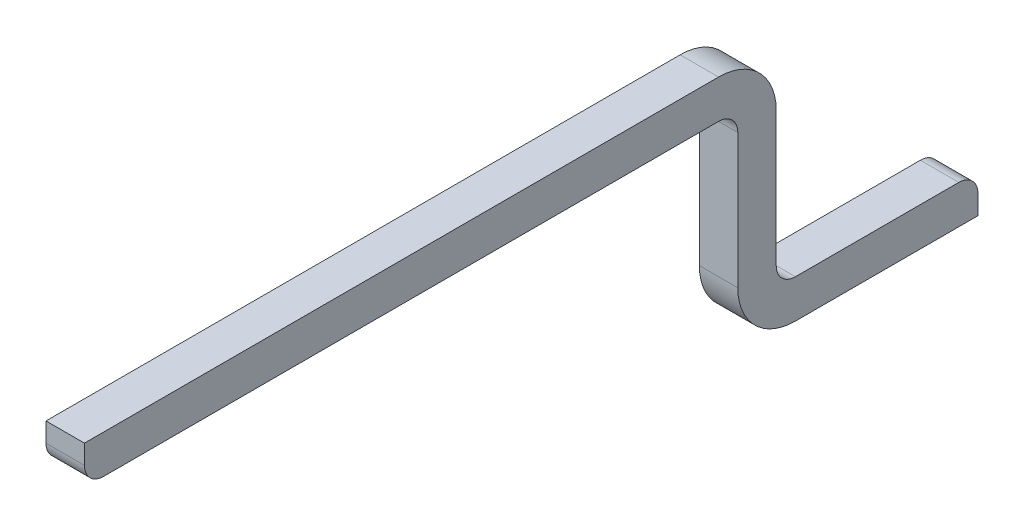
ISO-10303-21;
HEADER;
FILE_DESCRIPTION(('STEP AP214'),'2;1');
FILE_NAME('part.step','',(''),(''),'','','');
FILE_SCHEMA(('AUTOMOTIVE_DESIGN { 1 0 10303 214 1 1 1 1 }'));
ENDSEC;
DATA;
#1=APPLICATION_CONTEXT('core data for automotive mechanical design processes');
#2=APPLICATION_PROTOCOL_DEFINITION('international standard','automotive_design',2000,#1);
#3=PRODUCT_CONTEXT('',#1,'mechanical');
#4=PRODUCT('Part','Part','',(#3));
#5=PRODUCT_RELATED_PRODUCT_CATEGORY('part','',(#4));
#6=PRODUCT_DEFINITION_FORMATION('','',#4);
#7=PRODUCT_DEFINITION_CONTEXT('part definition',#1,'design');
#8=PRODUCT_DEFINITION('design','',#6,#7);
#9=PRODUCT_DEFINITION_SHAPE('','',#8);
#10=(LENGTH_UNIT() NAMED_UNIT(*) SI_UNIT(.MILLI.,.METRE.));
#11=(NAMED_UNIT(*) PLANE_ANGLE_UNIT() SI_UNIT($,.RADIAN.));
#12=(NAMED_UNIT(*) SI_UNIT($,.STERADIAN.) SOLID_ANGLE_UNIT());
#13=UNCERTAINTY_MEASURE_WITH_UNIT(LENGTH_MEASURE(1.E-05),#10,'distance_accuracy_value','');
#14=(GEOMETRIC_REPRESENTATION_CONTEXT(3) GLOBAL_UNCERTAINTY_ASSIGNED_CONTEXT((#13)) GLOBAL_UNIT_ASSIGNED_CONTEXT((#10,
#11,#12)) REPRESENTATION_CONTEXT('',''));
#15=CARTESIAN_POINT('',(0.,0.,0.));
#16=DIRECTION('',(0.,0.,1.));
#17=DIRECTION('',(1.,0.,0.));
#18=AXIS2_PLACEMENT_3D('',#15,#16,#17);
#19=CARTESIAN_POINT('',(-0.1,0.3,-4.5));
#20=DIRECTION('',(1.,0.,0.));
#21=DIRECTION('',(0.,0.,-1.));
#22=AXIS2_PLACEMENT_3D('',#19,#20,#21);
#23=PLANE('',#22);
#24=CARTESIAN_POINT('',(-0.1,0.1,-5.35));
#25=DIRECTION('',(-1.,0.,0.));
#26=DIRECTION('',(0.,0.,1.));
#27=AXIS2_PLACEMENT_3D('',#24,#25,#26);
#28=CIRCLE('',#27,0.1);
#29=CARTESIAN_POINT('',(-0.1,0.1,-5.45));
#30=VERTEX_POINT('',#29);
#31=CARTESIAN_POINT('',(-0.1,0.2,-5.35));
#32=VERTEX_POINT('',#31);
#33=EDGE_CURVE('E115',#30,#32,#28,.F.);
#34=ORIENTED_EDGE('',*,*,#33,.F.);
#35=DIRECTION('',(0.,1.,0.));
#36=VECTOR('',#35,1.);
#37=CARTESIAN_POINT('',(-0.1,0.3,-5.45));
#38=LINE('',#37,#36);
#39=CARTESIAN_POINT('',(-0.1,0.,-5.45));
#40=VERTEX_POINT('',#39);
#41=EDGE_CURVE('E138',#40,#30,#38,.T.);
#42=ORIENTED_EDGE('',*,*,#41,.F.);
#43=DIRECTION('',(0.,0.,-1.));
#44=VECTOR('',#43,1.);
#45=CARTESIAN_POINT('',(-0.1,0.,-4.5));
#46=LINE('',#45,#44);
#47=CARTESIAN_POINT('',(-0.1,0.,-4.5));
#48=VERTEX_POINT('',#47);
#49=EDGE_CURVE('E136',#48,#40,#46,.T.);
#50=ORIENTED_EDGE('',*,*,#49,.F.);
#51=CARTESIAN_POINT('',(-0.1,0.3,-4.5));
#52=DIRECTION('',(-1.,0.,0.));
#53=DIRECTION('',(0.,0.,1.));
#54=AXIS2_PLACEMENT_3D('',#51,#52,#53);
#55=CIRCLE('',#54,0.3);
#56=CARTESIAN_POINT('',(-0.1,0.3,-4.2));
#57=VERTEX_POINT('',#56);
#58=EDGE_CURVE('E132',#57,#48,#55,.F.);
#59=ORIENTED_EDGE('',*,*,#58,.F.);
#60=DIRECTION('',(0.,1.,0.));
#61=VECTOR('',#60,1.);
#62=CARTESIAN_POINT('',(-0.1,0.3,-4.2));
#63=LINE('',#62,#61);
#64=CARTESIAN_POINT('',(-0.1,1.,-4.2));
#65=VERTEX_POINT('',#64);
#66=EDGE_CURVE('E128',#65,#57,#63,.F.);
#67=ORIENTED_EDGE('',*,*,#66,.F.);
#68=CARTESIAN_POINT('',(-0.1,1.,-4.1));
#69=DIRECTION('',(-1.,0.,0.));
#70=DIRECTION('',(0.,0.,1.));
#71=AXIS2_PLACEMENT_3D('',#68,#69,#70);
#72=CIRCLE('',#71,0.1);
#73=CARTESIAN_POINT('',(-0.1,1.1,-4.1));
#74=VERTEX_POINT('',#73);
#75=EDGE_CURVE('E127',#74,#65,#72,.T.);
#76=ORIENTED_EDGE('',*,*,#75,.F.);
#77=DIRECTION('',(0.,0.,1.));
#78=VECTOR('',#77,1.);
#79=CARTESIAN_POINT('',(-0.1,1.1,-0.8));
#80=LINE('',#79,#78);
#81=CARTESIAN_POINT('',(-0.1,1.1,-0.9));
#82=VERTEX_POINT('',#81);
#83=EDGE_CURVE('E146',#74,#82,#80,.T.);
#84=ORIENTED_EDGE('',*,*,#83,.T.);
#85=CARTESIAN_POINT('',(-0.1,1.2,-0.9));
#86=DIRECTION('',(1.,0.,0.));
#87=DIRECTION('',(0.,0.,-1.));
#88=AXIS2_PLACEMENT_3D('',#85,#86,#87);
#89=CIRCLE('',#88,0.1);
#90=CARTESIAN_POINT('',(-0.1,1.2,-0.8));
#91=VERTEX_POINT('',#90);
#92=EDGE_CURVE('E143',#91,#82,#89,.T.);
#93=ORIENTED_EDGE('',*,*,#92,.F.);
#94=DIRECTION('',(0.,-1.,0.));
#95=VECTOR('',#94,1.);
#96=CARTESIAN_POINT('',(-0.1,1.1,-0.8));
#97=LINE('',#96,#95);
#98=CARTESIAN_POINT('',(-0.1,1.3,-0.8));
#99=VERTEX_POINT('',#98);
#100=EDGE_CURVE('E178',#99,#91,#97,.T.);
#101=ORIENTED_EDGE('',*,*,#100,.F.);
#102=DIRECTION('',(0.,0.,1.));
#103=VECTOR('',#102,1.);
#104=CARTESIAN_POINT('',(-0.1,1.3,-0.8));
#105=LINE('',#104,#103);
#106=CARTESIAN_POINT('',(-0.1,1.3,-4.1));
#107=VERTEX_POINT('',#106);
#108=EDGE_CURVE('E172',#107,#99,#105,.T.);
#109=ORIENTED_EDGE('',*,*,#108,.F.);
#110=CARTESIAN_POINT('',(-0.1,1.,-4.1));
#111=DIRECTION('',(-1.,0.,0.));
#112=DIRECTION('',(0.,0.,1.));
#113=AXIS2_PLACEMENT_3D('',#110,#111,#112);
#114=CIRCLE('',#113,0.3);
#115=CARTESIAN_POINT('',(-0.1,1.,-4.4));
#116=VERTEX_POINT('',#115);
#117=EDGE_CURVE('E139',#116,#107,#114,.F.);
#118=ORIENTED_EDGE('',*,*,#117,.F.);
#119=DIRECTION('',(0.,1.,0.));
#120=VECTOR('',#119,1.);
#121=CARTESIAN_POINT('',(-0.1,1.,-4.4));
#122=LINE('',#121,#120);
#123=CARTESIAN_POINT('',(-0.1,0.3,-4.4));
#124=VERTEX_POINT('',#123);
#125=EDGE_CURVE('E114',#124,#116,#122,.T.);
#126=ORIENTED_EDGE('',*,*,#125,.F.);
#127=CARTESIAN_POINT('',(-0.1,0.3,-4.5));
#128=DIRECTION('',(1.,0.,0.));
#129=DIRECTION('',(0.,0.,-1.));
#130=AXIS2_PLACEMENT_3D('',#127,#128,#129);
#131=CIRCLE('',#130,0.1);
#132=CARTESIAN_POINT('',(-0.1,0.2,-4.5));
#133=VERTEX_POINT('',#132);
#134=EDGE_CURVE('E20',#133,#124,#131,.F.);
#135=ORIENTED_EDGE('',*,*,#134,.F.);
#136=DIRECTION('',(0.,0.,-1.));
#137=VECTOR('',#136,1.);
#138=CARTESIAN_POINT('',(-0.1,0.2,-4.5));
#139=LINE('',#138,#137);
#140=EDGE_CURVE('E108',#32,#133,#139,.F.);
#141=ORIENTED_EDGE('',*,*,#140,.F.);
#142=EDGE_LOOP('',(#34,#42,#50,#59,#67,#76,#84,#93,#101,#109,#118,#126,#135,#141));
#143=FACE_BOUND('',#142,.T.);
#144=ADVANCED_FACE('F17',(#143),#23,.F.);
#145=CARTESIAN_POINT('',(0.1,1.,-4.4));
#146=DIRECTION('',(0.,0.,-1.));
#147=DIRECTION('',(-1.,0.,0.));
#148=AXIS2_PLACEMENT_3D('',#145,#146,#147);
#149=PLANE('',#148);
#150=DIRECTION('',(-1.,0.,0.));
#151=VECTOR('',#150,1.);
#152=CARTESIAN_POINT('',(0.1,1.,-4.4));
#153=LINE('',#152,#151);
#154=CARTESIAN_POINT('',(0.1,1.,-4.4));
#155=VERTEX_POINT('',#154);
#156=EDGE_CURVE('E142',#155,#116,#153,.T.);
#157=ORIENTED_EDGE('',*,*,#156,.F.);
#158=DIRECTION('',(0.,1.,0.));
#159=VECTOR('',#158,1.);
#160=CARTESIAN_POINT('',(0.1,0.3,-4.4));
#161=LINE('',#160,#159);
#162=CARTESIAN_POINT('',(0.1,0.3,-4.4));
#163=VERTEX_POINT('',#162);
#164=EDGE_CURVE('E152',#163,#155,#161,.T.);
#165=ORIENTED_EDGE('',*,*,#164,.F.);
#166=DIRECTION('',(1.,0.,0.));
#167=VECTOR('',#166,1.);
#168=CARTESIAN_POINT('',(0.1,0.3,-4.4));
#169=LINE('',#168,#167);
#170=EDGE_CURVE('E123',#163,#124,#169,.F.);
#171=ORIENTED_EDGE('',*,*,#170,.T.);
#172=ORIENTED_EDGE('',*,*,#125,.T.);
#173=EDGE_LOOP('',(#157,#165,#171,#172));
#174=FACE_BOUND('',#173,.T.);
#175=ADVANCED_FACE('F275',(#174),#149,.T.);
#176=CARTESIAN_POINT('',(0.1,1.,-4.1));
#177=DIRECTION('',(-1.,0.,0.));
#178=DIRECTION('',(0.,0.,1.));
#179=AXIS2_PLACEMENT_3D('',#176,#177,#178);
#180=CYLINDRICAL_SURFACE('',#179,0.3);
#181=CARTESIAN_POINT('',(0.1,1.,-4.1));
#182=DIRECTION('',(-1.,0.,0.));
#183=DIRECTION('',(0.,0.,1.));
#184=AXIS2_PLACEMENT_3D('',#181,#182,#183);
#185=CIRCLE('',#184,0.3);
#186=CARTESIAN_POINT('',(0.1,1.3,-4.1));
#187=VERTEX_POINT('',#186);
#188=EDGE_CURVE('E148',#155,#187,#185,.F.);
#189=ORIENTED_EDGE('',*,*,#188,.F.);
#190=ORIENTED_EDGE('',*,*,#156,.T.);
#191=ORIENTED_EDGE('',*,*,#117,.T.);
#192=DIRECTION('',(1.,0.,0.));
#193=VECTOR('',#192,1.);
#194=CARTESIAN_POINT('',(0.1,1.3,-4.1));
#195=LINE('',#194,#193);
#196=EDGE_CURVE('E175',#187,#107,#195,.F.);
#197=ORIENTED_EDGE('',*,*,#196,.F.);
#198=EDGE_LOOP('',(#189,#190,#191,#197));
#199=FACE_BOUND('',#198,.T.);
#200=ADVANCED_FACE('F273',(#199),#180,.T.);
#201=CARTESIAN_POINT('',(0.1,1.3,-0.8));
#202=DIRECTION('',(0.,1.,0.));
#203=DIRECTION('',(0.,0.,1.));
#204=AXIS2_PLACEMENT_3D('',#201,#202,#203);
#205=PLANE('',#204);
#206=DIRECTION('',(0.,0.,-1.));
#207=VECTOR('',#206,1.);
#208=CARTESIAN_POINT('',(0.1,1.3,-4.5));
#209=LINE('',#208,#207);
#210=CARTESIAN_POINT('',(0.1,1.3,-0.8));
#211=VERTEX_POINT('',#210);
#212=EDGE_CURVE('E151',#187,#211,#209,.F.);
#213=ORIENTED_EDGE('',*,*,#212,.F.);
#214=ORIENTED_EDGE('',*,*,#196,.T.);
#215=ORIENTED_EDGE('',*,*,#108,.T.);
#216=DIRECTION('',(1.,0.,0.));
#217=VECTOR('',#216,1.);
#218=CARTESIAN_POINT('',(0.1,1.3,-0.8));
#219=LINE('',#218,#217);
#220=EDGE_CURVE('E179',#211,#99,#219,.F.);
#221=ORIENTED_EDGE('',*,*,#220,.F.);
#222=EDGE_LOOP('',(#213,#214,#215,#221));
#223=FACE_BOUND('',#222,.T.);
#224=ADVANCED_FACE('F267',(#223),#205,.T.);
#225=CARTESIAN_POINT('',(0.1,1.1,-0.8));
#226=DIRECTION('',(0.,0.,1.));
#227=DIRECTION('',(0.,-1.,0.));
#228=AXIS2_PLACEMENT_3D('',#225,#226,#227);
#229=PLANE('',#228);
#230=DIRECTION('',(0.,1.,0.));
#231=VECTOR('',#230,1.);
#232=CARTESIAN_POINT('',(0.1,0.3,-0.8));
#233=LINE('',#232,#231);
#234=CARTESIAN_POINT('',(0.1,1.2,-0.8));
#235=VERTEX_POINT('',#234);
#236=EDGE_CURVE('E157',#211,#235,#233,.F.);
#237=ORIENTED_EDGE('',*,*,#236,.F.);
#238=ORIENTED_EDGE('',*,*,#220,.T.);
#239=ORIENTED_EDGE('',*,*,#100,.T.);
#240=DIRECTION('',(1.,0.,0.));
#241=VECTOR('',#240,1.);
#242=CARTESIAN_POINT('',(0.1,1.2,-0.8));
#243=LINE('',#242,#241);
#244=EDGE_CURVE('E147',#235,#91,#243,.F.);
#245=ORIENTED_EDGE('',*,*,#244,.F.);
#246=EDGE_LOOP('',(#237,#238,#239,#245));
#247=FACE_BOUND('',#246,.T.);
#248=ADVANCED_FACE('F269',(#247),#229,.T.);
#249=CARTESIAN_POINT('',(0.1,1.2,-0.9));
#250=DIRECTION('',(1.,0.,0.));
#251=DIRECTION('',(0.,0.,-1.));
#252=AXIS2_PLACEMENT_3D('',#249,#250,#251);
#253=CYLINDRICAL_SURFACE('',#252,0.1);
#254=ORIENTED_EDGE('',*,*,#92,.T.);
#255=DIRECTION('',(1.,0.,0.));
#256=VECTOR('',#255,1.);
#257=CARTESIAN_POINT('',(0.1,1.1,-0.9));
#258=LINE('',#257,#256);
#259=CARTESIAN_POINT('',(0.1,1.1,-0.9));
#260=VERTEX_POINT('',#259);
#261=EDGE_CURVE('E189',#82,#260,#258,.T.);
#262=ORIENTED_EDGE('',*,*,#261,.T.);
#263=CARTESIAN_POINT('',(0.1,1.2,-0.9));
#264=DIRECTION('',(1.,0.,0.));
#265=DIRECTION('',(0.,0.,-1.));
#266=AXIS2_PLACEMENT_3D('',#263,#264,#265);
#267=CIRCLE('',#266,0.1);
#268=EDGE_CURVE('E153',#235,#260,#267,.T.);
#269=ORIENTED_EDGE('',*,*,#268,.F.);
#270=ORIENTED_EDGE('',*,*,#244,.T.);
#271=EDGE_LOOP('',(#254,#262,#269,#270));
#272=FACE_BOUND('',#271,.T.);
#273=ADVANCED_FACE('F312',(#272),#253,.T.);
#274=CARTESIAN_POINT('',(0.1,1.1,-0.8));
#275=DIRECTION('',(0.,1.,0.));
#276=DIRECTION('',(0.,0.,1.));
#277=AXIS2_PLACEMENT_3D('',#274,#275,#276);
#278=PLANE('',#277);
#279=ORIENTED_EDGE('',*,*,#261,.F.);
#280=ORIENTED_EDGE('',*,*,#83,.F.);
#281=DIRECTION('',(-1.,0.,0.));
#282=VECTOR('',#281,1.);
#283=CARTESIAN_POINT('',(0.1,1.1,-4.1));
#284=LINE('',#283,#282);
#285=CARTESIAN_POINT('',(0.1,1.1,-4.1));
#286=VERTEX_POINT('',#285);
#287=EDGE_CURVE('E202',#74,#286,#284,.F.);
#288=ORIENTED_EDGE('',*,*,#287,.T.);
#289=DIRECTION('',(0.,0.,-1.));
#290=VECTOR('',#289,1.);
#291=CARTESIAN_POINT('',(0.1,1.1,-4.5));
#292=LINE('',#291,#290);
#293=EDGE_CURVE('E156',#260,#286,#292,.T.);
#294=ORIENTED_EDGE('',*,*,#293,.F.);
#295=EDGE_LOOP('',(#279,#280,#288,#294));
#296=FACE_BOUND('',#295,.T.);
#297=ADVANCED_FACE('F309',(#296),#278,.F.);
#298=CARTESIAN_POINT('',(0.1,1.,-4.1));
#299=DIRECTION('',(-1.,0.,0.));
#300=DIRECTION('',(0.,0.,1.));
#301=AXIS2_PLACEMENT_3D('',#298,#299,#300);
#302=CYLINDRICAL_SURFACE('',#301,0.1);
#303=DIRECTION('',(-1.,0.,0.));
#304=VECTOR('',#303,1.);
#305=CARTESIAN_POINT('',(0.1,1.,-4.2));
#306=LINE('',#305,#304);
#307=CARTESIAN_POINT('',(0.1,1.,-4.2));
#308=VERTEX_POINT('',#307);
#309=EDGE_CURVE('E204',#65,#308,#306,.F.);
#310=ORIENTED_EDGE('',*,*,#309,.T.);
#311=CARTESIAN_POINT('',(0.1,1.,-4.1));
#312=DIRECTION('',(-1.,0.,0.));
#313=DIRECTION('',(0.,0.,1.));
#314=AXIS2_PLACEMENT_3D('',#311,#312,#313);
#315=CIRCLE('',#314,0.1);
#316=EDGE_CURVE('E158',#286,#308,#315,.T.);
#317=ORIENTED_EDGE('',*,*,#316,.F.);
#318=ORIENTED_EDGE('',*,*,#287,.F.);
#319=ORIENTED_EDGE('',*,*,#75,.T.);
#320=EDGE_LOOP('',(#310,#317,#318,#319));
#321=FACE_BOUND('',#320,.T.);
#322=ADVANCED_FACE('F305',(#321),#302,.F.);
#323=CARTESIAN_POINT('',(0.1,1.,-4.2));
#324=DIRECTION('',(0.,0.,-1.));
#325=DIRECTION('',(-1.,0.,0.));
#326=AXIS2_PLACEMENT_3D('',#323,#324,#325);
#327=PLANE('',#326);
#328=DIRECTION('',(-1.,0.,0.));
#329=VECTOR('',#328,1.);
#330=CARTESIAN_POINT('',(0.1,0.3,-4.2));
#331=LINE('',#330,#329);
#332=CARTESIAN_POINT('',(0.1,0.3,-4.2));
#333=VERTEX_POINT('',#332);
#334=EDGE_CURVE('E206',#333,#57,#331,.T.);
#335=ORIENTED_EDGE('',*,*,#334,.F.);
#336=DIRECTION('',(0.,1.,0.));
#337=VECTOR('',#336,1.);
#338=CARTESIAN_POINT('',(0.1,0.3,-4.2));
#339=LINE('',#338,#337);
#340=EDGE_CURVE('E161',#308,#333,#339,.F.);
#341=ORIENTED_EDGE('',*,*,#340,.F.);
#342=ORIENTED_EDGE('',*,*,#309,.F.);
#343=ORIENTED_EDGE('',*,*,#66,.T.);
#344=EDGE_LOOP('',(#335,#341,#342,#343));
#345=FACE_BOUND('',#344,.T.);
#346=ADVANCED_FACE('F301',(#345),#327,.F.);
#347=CARTESIAN_POINT('',(0.1,0.3,-4.5));
#348=DIRECTION('',(-1.,0.,0.));
#349=DIRECTION('',(0.,0.,1.));
#350=AXIS2_PLACEMENT_3D('',#347,#348,#349);
#351=CYLINDRICAL_SURFACE('',#350,0.3);
#352=CARTESIAN_POINT('',(0.1,0.3,-4.5));
#353=DIRECTION('',(-1.,0.,0.));
#354=DIRECTION('',(0.,0.,1.));
#355=AXIS2_PLACEMENT_3D('',#352,#353,#354);
#356=CIRCLE('',#355,0.3);
#357=CARTESIAN_POINT('',(0.1,0.,-4.5));
#358=VERTEX_POINT('',#357);
#359=EDGE_CURVE('E162',#333,#358,#356,.F.);
#360=ORIENTED_EDGE('',*,*,#359,.F.);
#361=ORIENTED_EDGE('',*,*,#334,.T.);
#362=ORIENTED_EDGE('',*,*,#58,.T.);
#363=DIRECTION('',(1.,0.,0.));
#364=VECTOR('',#363,1.);
#365=CARTESIAN_POINT('',(0.1,0.,-4.5));
#366=LINE('',#365,#364);
#367=EDGE_CURVE('E209',#48,#358,#366,.T.);
#368=ORIENTED_EDGE('',*,*,#367,.T.);
#369=EDGE_LOOP('',(#360,#361,#362,#368));
#370=FACE_BOUND('',#369,.T.);
#371=ADVANCED_FACE('F298',(#370),#351,.T.);
#372=CARTESIAN_POINT('',(0.1,0.,-4.5));
#373=DIRECTION('',(0.,1.,0.));
#374=DIRECTION('',(0.,0.,1.));
#375=AXIS2_PLACEMENT_3D('',#372,#373,#374);
#376=PLANE('',#375);
#377=DIRECTION('',(-1.,0.,0.));
#378=VECTOR('',#377,1.);
#379=CARTESIAN_POINT('',(0.1,0.,-5.45));
#380=LINE('',#379,#378);
#381=CARTESIAN_POINT('',(0.1,0.,-5.45));
#382=VERTEX_POINT('',#381);
#383=EDGE_CURVE('E211',#382,#40,#380,.T.);
#384=ORIENTED_EDGE('',*,*,#383,.F.);
#385=DIRECTION('',(0.,0.,-1.));
#386=VECTOR('',#385,1.);
#387=CARTESIAN_POINT('',(0.1,0.,-4.5));
#388=LINE('',#387,#386);
#389=EDGE_CURVE('E165',#358,#382,#388,.T.);
#390=ORIENTED_EDGE('',*,*,#389,.F.);
#391=ORIENTED_EDGE('',*,*,#367,.F.);
#392=ORIENTED_EDGE('',*,*,#49,.T.);
#393=EDGE_LOOP('',(#384,#390,#391,#392));
#394=FACE_BOUND('',#393,.T.);
#395=ADVANCED_FACE('F257',(#394),#376,.F.);
#396=CARTESIAN_POINT('',(0.1,0.2,-5.45));
#397=DIRECTION('',(0.,0.,-1.));
#398=DIRECTION('',(-1.,0.,0.));
#399=AXIS2_PLACEMENT_3D('',#396,#397,#398);
#400=PLANE('',#399);
#401=DIRECTION('',(0.,1.,0.));
#402=VECTOR('',#401,1.);
#403=CARTESIAN_POINT('',(0.1,0.3,-5.45));
#404=LINE('',#403,#402);
#405=CARTESIAN_POINT('',(0.1,0.1,-5.45));
#406=VERTEX_POINT('',#405);
#407=EDGE_CURVE('E168',#382,#406,#404,.T.);
#408=ORIENTED_EDGE('',*,*,#407,.F.);
#409=ORIENTED_EDGE('',*,*,#383,.T.);
#410=ORIENTED_EDGE('',*,*,#41,.T.);
#411=DIRECTION('',(-1.,0.,0.));
#412=VECTOR('',#411,1.);
#413=CARTESIAN_POINT('',(0.1,0.1,-5.45));
#414=LINE('',#413,#412);
#415=EDGE_CURVE('E216',#406,#30,#414,.T.);
#416=ORIENTED_EDGE('',*,*,#415,.F.);
#417=EDGE_LOOP('',(#408,#409,#410,#416));
#418=FACE_BOUND('',#417,.T.);
#419=ADVANCED_FACE('F253',(#418),#400,.T.);
#420=CARTESIAN_POINT('',(0.1,0.1,-5.35));
#421=DIRECTION('',(-1.,0.,0.));
#422=DIRECTION('',(0.,0.,1.));
#423=AXIS2_PLACEMENT_3D('',#420,#421,#422);
#424=CYLINDRICAL_SURFACE('',#423,0.1);
#425=ORIENTED_EDGE('',*,*,#33,.T.);
#426=DIRECTION('',(1.,0.,0.));
#427=VECTOR('',#426,1.);
#428=CARTESIAN_POINT('',(0.1,0.2,-5.35));
#429=LINE('',#428,#427);
#430=CARTESIAN_POINT('',(0.1,0.2,-5.35));
#431=VERTEX_POINT('',#430);
#432=EDGE_CURVE('E110',#431,#32,#429,.F.);
#433=ORIENTED_EDGE('',*,*,#432,.F.);
#434=CARTESIAN_POINT('',(0.1,0.1,-5.35));
#435=DIRECTION('',(-1.,0.,0.));
#436=DIRECTION('',(0.,0.,1.));
#437=AXIS2_PLACEMENT_3D('',#434,#435,#436);
#438=CIRCLE('',#437,0.1);
#439=EDGE_CURVE('E166',#406,#431,#438,.F.);
#440=ORIENTED_EDGE('',*,*,#439,.F.);
#441=ORIENTED_EDGE('',*,*,#415,.T.);
#442=EDGE_LOOP('',(#425,#433,#440,#441));
#443=FACE_BOUND('',#442,.T.);
#444=ADVANCED_FACE('F248',(#443),#424,.T.);
#445=CARTESIAN_POINT('',(0.1,0.2,-4.75));
#446=DIRECTION('',(0.,1.,0.));
#447=DIRECTION('',(0.,0.,1.));
#448=AXIS2_PLACEMENT_3D('',#445,#446,#447);
#449=PLANE('',#448);
#450=ORIENTED_EDGE('',*,*,#432,.T.);
#451=ORIENTED_EDGE('',*,*,#140,.T.);
#452=DIRECTION('',(1.,0.,0.));
#453=VECTOR('',#452,1.);
#454=CARTESIAN_POINT('',(0.1,0.2,-4.5));
#455=LINE('',#454,#453);
#456=CARTESIAN_POINT('',(0.1,0.2,-4.5));
#457=VERTEX_POINT('',#456);
#458=EDGE_CURVE('E35',#133,#457,#455,.T.);
#459=ORIENTED_EDGE('',*,*,#458,.T.);
#460=DIRECTION('',(0.,0.,-1.));
#461=VECTOR('',#460,1.);
#462=CARTESIAN_POINT('',(0.1,0.2,-4.5));
#463=LINE('',#462,#461);
#464=EDGE_CURVE('E26',#431,#457,#463,.F.);
#465=ORIENTED_EDGE('',*,*,#464,.F.);
#466=EDGE_LOOP('',(#450,#451,#459,#465));
#467=FACE_BOUND('',#466,.T.);
#468=ADVANCED_FACE('F109',(#467),#449,.T.);
#469=CARTESIAN_POINT('',(0.1,0.3,-4.5));
#470=DIRECTION('',(1.,0.,0.));
#471=DIRECTION('',(0.,0.,-1.));
#472=AXIS2_PLACEMENT_3D('',#469,#470,#471);
#473=CYLINDRICAL_SURFACE('',#472,0.1);
#474=ORIENTED_EDGE('',*,*,#170,.F.);
#475=CARTESIAN_POINT('',(0.1,0.3,-4.5));
#476=DIRECTION('',(1.,0.,0.));
#477=DIRECTION('',(0.,0.,-1.));
#478=AXIS2_PLACEMENT_3D('',#475,#476,#477);
#479=CIRCLE('',#478,0.1);
#480=EDGE_CURVE('E11',#457,#163,#479,.F.);
#481=ORIENTED_EDGE('',*,*,#480,.F.);
#482=ORIENTED_EDGE('',*,*,#458,.F.);
#483=ORIENTED_EDGE('',*,*,#134,.T.);
#484=EDGE_LOOP('',(#474,#481,#482,#483));
#485=FACE_BOUND('',#484,.T.);
#486=ADVANCED_FACE('F120',(#485),#473,.F.);
#487=CARTESIAN_POINT('',(0.1,0.3,-4.5));
#488=DIRECTION('',(1.,0.,0.));
#489=DIRECTION('',(0.,0.,-1.));
#490=AXIS2_PLACEMENT_3D('',#487,#488,#489);
#491=PLANE('',#490);
#492=ORIENTED_EDGE('',*,*,#464,.T.);
#493=ORIENTED_EDGE('',*,*,#480,.T.);
#494=ORIENTED_EDGE('',*,*,#164,.T.);
#495=ORIENTED_EDGE('',*,*,#188,.T.);
#496=ORIENTED_EDGE('',*,*,#212,.T.);
#497=ORIENTED_EDGE('',*,*,#236,.T.);
#498=ORIENTED_EDGE('',*,*,#268,.T.);
#499=ORIENTED_EDGE('',*,*,#293,.T.);
#500=ORIENTED_EDGE('',*,*,#316,.T.);
#501=ORIENTED_EDGE('',*,*,#340,.T.);
#502=ORIENTED_EDGE('',*,*,#359,.T.);
#503=ORIENTED_EDGE('',*,*,#389,.T.);
#504=ORIENTED_EDGE('',*,*,#407,.T.);
#505=ORIENTED_EDGE('',*,*,#439,.T.);
#506=EDGE_LOOP('',(#492,#493,#494,#495,#496,#497,#498,#499,#500,#501,#502,#503,#504,#505));
#507=FACE_BOUND('',#506,.T.);
#508=ADVANCED_FACE('F244',(#507),#491,.T.);
#509=CLOSED_SHELL('',(#144,#175,#200,#224,#248,#273,#297,#322,#346,#371,#395,#419,#444,#468,
#486,#508));
#510=MANIFOLD_SOLID_BREP('B1',#509);
#511=ADVANCED_BREP_SHAPE_REPRESENTATION('',(#18,#510),#14);
#512=SHAPE_DEFINITION_REPRESENTATION(#9,#511);
ENDSEC;
END-ISO-10303-21;
